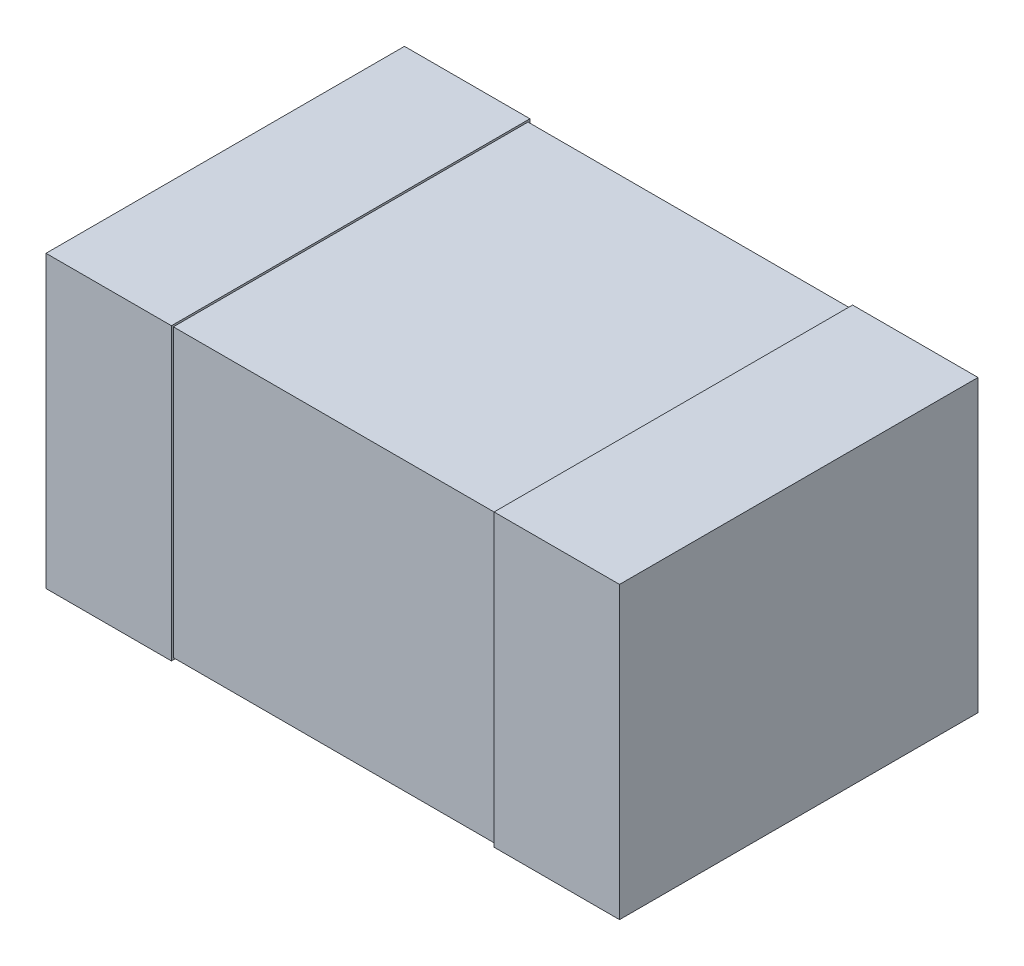
ISO-10303-21;
HEADER;
FILE_DESCRIPTION(('STEP AP214'),'2;1');
FILE_NAME('part.step','',(''),(''),'','','');
FILE_SCHEMA(('AUTOMOTIVE_DESIGN { 1 0 10303 214 1 1 1 1 }'));
ENDSEC;
DATA;
#1=APPLICATION_CONTEXT('core data for automotive mechanical design processes');
#2=APPLICATION_PROTOCOL_DEFINITION('international standard','automotive_design',2000,#1);
#3=PRODUCT_CONTEXT('',#1,'mechanical');
#4=PRODUCT('Part','Part','',(#3));
#5=PRODUCT_RELATED_PRODUCT_CATEGORY('part','',(#4));
#6=PRODUCT_DEFINITION_FORMATION('','',#4);
#7=PRODUCT_DEFINITION_CONTEXT('part definition',#1,'design');
#8=PRODUCT_DEFINITION('design','',#6,#7);
#9=PRODUCT_DEFINITION_SHAPE('','',#8);
#10=(LENGTH_UNIT() NAMED_UNIT(*) SI_UNIT(.MILLI.,.METRE.));
#11=(NAMED_UNIT(*) PLANE_ANGLE_UNIT() SI_UNIT($,.RADIAN.));
#12=(NAMED_UNIT(*) SI_UNIT($,.STERADIAN.) SOLID_ANGLE_UNIT());
#13=UNCERTAINTY_MEASURE_WITH_UNIT(LENGTH_MEASURE(1.E-05),#10,'distance_accuracy_value','');
#14=(GEOMETRIC_REPRESENTATION_CONTEXT(3) GLOBAL_UNCERTAINTY_ASSIGNED_CONTEXT((#13)) GLOBAL_UNIT_ASSIGNED_CONTEXT((#10,
#11,#12)) REPRESENTATION_CONTEXT('',''));
#15=CARTESIAN_POINT('',(0.,0.,0.));
#16=DIRECTION('',(0.,0.,1.));
#17=DIRECTION('',(1.,0.,0.));
#18=AXIS2_PLACEMENT_3D('',#15,#16,#17);
#19=CARTESIAN_POINT('',(0.8,-0.405,0.0762));
#20=DIRECTION('',(1.,0.,0.));
#21=DIRECTION('',(0.,0.,-1.));
#22=AXIS2_PLACEMENT_3D('',#19,#20,#21);
#23=PLANE('',#22);
#24=DIRECTION('',(0.,0.,-1.));
#25=VECTOR('',#24,1.);
#26=CARTESIAN_POINT('',(0.8,-0.405,0.0762));
#27=LINE('',#26,#25);
#28=CARTESIAN_POINT('',(0.8,-0.405,0.0762));
#29=VERTEX_POINT('',#28);
#30=CARTESIAN_POINT('',(0.8,-0.405,1.0762));
#31=VERTEX_POINT('',#30);
#32=EDGE_CURVE('E118',#29,#31,#27,.F.);
#33=ORIENTED_EDGE('',*,*,#32,.F.);
#34=DIRECTION('',(0.,1.,0.));
#35=VECTOR('',#34,1.);
#36=CARTESIAN_POINT('',(0.8,0.,0.0762));
#37=LINE('',#36,#35);
#38=CARTESIAN_POINT('',(0.8,0.405,0.0762));
#39=VERTEX_POINT('',#38);
#40=EDGE_CURVE('E20',#29,#39,#37,.T.);
#41=ORIENTED_EDGE('',*,*,#40,.T.);
#42=DIRECTION('',(0.,0.,1.));
#43=VECTOR('',#42,1.);
#44=CARTESIAN_POINT('',(0.8,0.405,0.0762));
#45=LINE('',#44,#43);
#46=CARTESIAN_POINT('',(0.8,0.405,1.0762));
#47=VERTEX_POINT('',#46);
#48=EDGE_CURVE('E108',#47,#39,#45,.F.);
#49=ORIENTED_EDGE('',*,*,#48,.F.);
#50=DIRECTION('',(0.,1.,0.));
#51=VECTOR('',#50,1.);
#52=CARTESIAN_POINT('',(0.8,0.,1.0762));
#53=LINE('',#52,#51);
#54=EDGE_CURVE('E103',#31,#47,#53,.T.);
#55=ORIENTED_EDGE('',*,*,#54,.F.);
#56=EDGE_LOOP('',(#33,#41,#49,#55));
#57=FACE_BOUND('',#56,.T.);
#58=ADVANCED_FACE('F17',(#57),#23,.T.);
#59=CARTESIAN_POINT('',(-0.8,0.405,0.0762));
#60=DIRECTION('',(-1.,0.,0.));
#61=DIRECTION('',(0.,0.,1.));
#62=AXIS2_PLACEMENT_3D('',#59,#60,#61);
#63=PLANE('',#62);
#64=DIRECTION('',(0.,0.,1.));
#65=VECTOR('',#64,1.);
#66=CARTESIAN_POINT('',(-0.8,0.405,0.0762));
#67=LINE('',#66,#65);
#68=CARTESIAN_POINT('',(-0.8,0.405,0.0762));
#69=VERTEX_POINT('',#68);
#70=CARTESIAN_POINT('',(-0.8,0.405,1.0762));
#71=VERTEX_POINT('',#70);
#72=EDGE_CURVE('E148',#69,#71,#67,.T.);
#73=ORIENTED_EDGE('',*,*,#72,.F.);
#74=DIRECTION('',(0.,1.,0.));
#75=VECTOR('',#74,1.);
#76=CARTESIAN_POINT('',(-0.8,0.,0.0762));
#77=LINE('',#76,#75);
#78=CARTESIAN_POINT('',(-0.8,-0.405,0.0762));
#79=VERTEX_POINT('',#78);
#80=EDGE_CURVE('E134',#69,#79,#77,.F.);
#81=ORIENTED_EDGE('',*,*,#80,.T.);
#82=DIRECTION('',(0.,0.,-1.));
#83=VECTOR('',#82,1.);
#84=CARTESIAN_POINT('',(-0.8,-0.405,0.0762));
#85=LINE('',#84,#83);
#86=CARTESIAN_POINT('',(-0.8,-0.405,1.0762));
#87=VERTEX_POINT('',#86);
#88=EDGE_CURVE('E137',#87,#79,#85,.T.);
#89=ORIENTED_EDGE('',*,*,#88,.F.);
#90=DIRECTION('',(0.,1.,0.));
#91=VECTOR('',#90,1.);
#92=CARTESIAN_POINT('',(-0.8,0.,1.0762));
#93=LINE('',#92,#91);
#94=EDGE_CURVE('E141',#71,#87,#93,.F.);
#95=ORIENTED_EDGE('',*,*,#94,.F.);
#96=EDGE_LOOP('',(#73,#81,#89,#95));
#97=FACE_BOUND('',#96,.T.);
#98=ADVANCED_FACE('F236',(#97),#63,.T.);
#99=CARTESIAN_POINT('',(0.,0.,0.0762));
#100=DIRECTION('',(0.,0.,1.));
#101=DIRECTION('',(1.,0.,0.));
#102=AXIS2_PLACEMENT_3D('',#99,#100,#101);
#103=PLANE('',#102);
#104=ORIENTED_EDGE('',*,*,#40,.F.);
#105=DIRECTION('',(1.,0.,0.));
#106=VECTOR('',#105,1.);
#107=CARTESIAN_POINT('',(-0.8,-0.405,0.0762));
#108=LINE('',#107,#106);
#109=CARTESIAN_POINT('',(0.45,-0.405,0.0762));
#110=VERTEX_POINT('',#109);
#111=EDGE_CURVE('E129',#110,#29,#108,.T.);
#112=ORIENTED_EDGE('',*,*,#111,.F.);
#113=DIRECTION('',(0.,1.,0.));
#114=VECTOR('',#113,1.);
#115=CARTESIAN_POINT('',(0.45,-0.405,0.0762));
#116=LINE('',#115,#114);
#117=CARTESIAN_POINT('',(0.45,0.405,0.0762));
#118=VERTEX_POINT('',#117);
#119=EDGE_CURVE('E124',#110,#118,#116,.T.);
#120=ORIENTED_EDGE('',*,*,#119,.T.);
#121=DIRECTION('',(1.,0.,0.));
#122=VECTOR('',#121,1.);
#123=CARTESIAN_POINT('',(0.8,0.405,0.0762));
#124=LINE('',#123,#122);
#125=EDGE_CURVE('E113',#39,#118,#124,.F.);
#126=ORIENTED_EDGE('',*,*,#125,.F.);
#127=EDGE_LOOP('',(#104,#112,#120,#126));
#128=FACE_BOUND('',#127,.T.);
#129=ADVANCED_FACE('F123',(#128),#103,.F.);
#130=CARTESIAN_POINT('',(0.8,0.405,0.0762));
#131=DIRECTION('',(0.,1.,0.));
#132=DIRECTION('',(0.,0.,1.));
#133=AXIS2_PLACEMENT_3D('',#130,#131,#132);
#134=PLANE('',#133);
#135=ORIENTED_EDGE('',*,*,#125,.T.);
#136=DIRECTION('',(0.,0.,-1.));
#137=VECTOR('',#136,1.);
#138=CARTESIAN_POINT('',(0.45,0.405,0.081534));
#139=LINE('',#138,#137);
#140=CARTESIAN_POINT('',(0.45,0.405,1.0762));
#141=VERTEX_POINT('',#140);
#142=EDGE_CURVE('E155',#118,#141,#139,.F.);
#143=ORIENTED_EDGE('',*,*,#142,.T.);
#144=DIRECTION('',(1.,0.,0.));
#145=VECTOR('',#144,1.);
#146=CARTESIAN_POINT('',(0.,0.405,1.0762));
#147=LINE('',#146,#145);
#148=EDGE_CURVE('E115',#47,#141,#147,.F.);
#149=ORIENTED_EDGE('',*,*,#148,.F.);
#150=ORIENTED_EDGE('',*,*,#48,.T.);
#151=EDGE_LOOP('',(#135,#143,#149,#150));
#152=FACE_BOUND('',#151,.T.);
#153=ADVANCED_FACE('F110',(#152),#134,.T.);
#154=CARTESIAN_POINT('',(0.,0.,1.0762));
#155=DIRECTION('',(0.,0.,1.));
#156=DIRECTION('',(1.,0.,0.));
#157=AXIS2_PLACEMENT_3D('',#154,#155,#156);
#158=PLANE('',#157);
#159=ORIENTED_EDGE('',*,*,#148,.T.);
#160=DIRECTION('',(0.,1.,0.));
#161=VECTOR('',#160,1.);
#162=CARTESIAN_POINT('',(0.45,-0.405,1.0762));
#163=LINE('',#162,#161);
#164=CARTESIAN_POINT('',(0.45,-0.405,1.0762));
#165=VERTEX_POINT('',#164);
#166=EDGE_CURVE('E157',#141,#165,#163,.F.);
#167=ORIENTED_EDGE('',*,*,#166,.T.);
#168=DIRECTION('',(1.,0.,0.));
#169=VECTOR('',#168,1.);
#170=CARTESIAN_POINT('',(-0.8,-0.405,1.0762));
#171=LINE('',#170,#169);
#172=EDGE_CURVE('E132',#31,#165,#171,.F.);
#173=ORIENTED_EDGE('',*,*,#172,.F.);
#174=ORIENTED_EDGE('',*,*,#54,.T.);
#175=EDGE_LOOP('',(#159,#167,#173,#174));
#176=FACE_BOUND('',#175,.T.);
#177=ADVANCED_FACE('F270',(#176),#158,.T.);
#178=CARTESIAN_POINT('',(-0.8,-0.405,0.0762));
#179=DIRECTION('',(0.,-1.,0.));
#180=DIRECTION('',(0.,0.,-1.));
#181=AXIS2_PLACEMENT_3D('',#178,#179,#180);
#182=PLANE('',#181);
#183=ORIENTED_EDGE('',*,*,#172,.T.);
#184=DIRECTION('',(0.,0.,-1.));
#185=VECTOR('',#184,1.);
#186=CARTESIAN_POINT('',(0.45,-0.405,0.081534));
#187=LINE('',#186,#185);
#188=EDGE_CURVE('E160',#165,#110,#187,.T.);
#189=ORIENTED_EDGE('',*,*,#188,.T.);
#190=ORIENTED_EDGE('',*,*,#111,.T.);
#191=ORIENTED_EDGE('',*,*,#32,.T.);
#192=EDGE_LOOP('',(#183,#189,#190,#191));
#193=FACE_BOUND('',#192,.T.);
#194=ADVANCED_FACE('F267',(#193),#182,.T.);
#195=CARTESIAN_POINT('',(0.,0.,0.0762));
#196=DIRECTION('',(0.,0.,1.));
#197=DIRECTION('',(1.,0.,0.));
#198=AXIS2_PLACEMENT_3D('',#195,#196,#197);
#199=PLANE('',#198);
#200=ORIENTED_EDGE('',*,*,#80,.F.);
#201=DIRECTION('',(1.,0.,0.));
#202=VECTOR('',#201,1.);
#203=CARTESIAN_POINT('',(0.8,0.405,0.0762));
#204=LINE('',#203,#202);
#205=CARTESIAN_POINT('',(-0.45,0.405,0.0762));
#206=VERTEX_POINT('',#205);
#207=EDGE_CURVE('E145',#206,#69,#204,.F.);
#208=ORIENTED_EDGE('',*,*,#207,.F.);
#209=DIRECTION('',(0.,1.,0.));
#210=VECTOR('',#209,1.);
#211=CARTESIAN_POINT('',(-0.45,-0.405,0.0762));
#212=LINE('',#211,#210);
#213=CARTESIAN_POINT('',(-0.45,-0.405,0.0762));
#214=VERTEX_POINT('',#213);
#215=EDGE_CURVE('E173',#206,#214,#212,.F.);
#216=ORIENTED_EDGE('',*,*,#215,.T.);
#217=DIRECTION('',(1.,0.,0.));
#218=VECTOR('',#217,1.);
#219=CARTESIAN_POINT('',(-0.8,-0.405,0.0762));
#220=LINE('',#219,#218);
#221=EDGE_CURVE('E139',#79,#214,#220,.T.);
#222=ORIENTED_EDGE('',*,*,#221,.F.);
#223=EDGE_LOOP('',(#200,#208,#216,#222));
#224=FACE_BOUND('',#223,.T.);
#225=ADVANCED_FACE('F228',(#224),#199,.F.);
#226=CARTESIAN_POINT('',(-0.8,-0.405,0.0762));
#227=DIRECTION('',(0.,-1.,0.));
#228=DIRECTION('',(0.,0.,-1.));
#229=AXIS2_PLACEMENT_3D('',#226,#227,#228);
#230=PLANE('',#229);
#231=ORIENTED_EDGE('',*,*,#221,.T.);
#232=DIRECTION('',(0.,0.,1.));
#233=VECTOR('',#232,1.);
#234=CARTESIAN_POINT('',(-0.45,-0.405,0.0762));
#235=LINE('',#234,#233);
#236=CARTESIAN_POINT('',(-0.45,-0.405,1.0762));
#237=VERTEX_POINT('',#236);
#238=EDGE_CURVE('E176',#214,#237,#235,.T.);
#239=ORIENTED_EDGE('',*,*,#238,.T.);
#240=DIRECTION('',(1.,0.,0.));
#241=VECTOR('',#240,1.);
#242=CARTESIAN_POINT('',(0.,-0.405,1.0762));
#243=LINE('',#242,#241);
#244=EDGE_CURVE('E143',#87,#237,#243,.T.);
#245=ORIENTED_EDGE('',*,*,#244,.F.);
#246=ORIENTED_EDGE('',*,*,#88,.T.);
#247=EDGE_LOOP('',(#231,#239,#245,#246));
#248=FACE_BOUND('',#247,.T.);
#249=ADVANCED_FACE('F224',(#248),#230,.T.);
#250=CARTESIAN_POINT('',(0.,0.,1.0762));
#251=DIRECTION('',(0.,0.,1.));
#252=DIRECTION('',(1.,0.,0.));
#253=AXIS2_PLACEMENT_3D('',#250,#251,#252);
#254=PLANE('',#253);
#255=ORIENTED_EDGE('',*,*,#244,.T.);
#256=DIRECTION('',(0.,1.,0.));
#257=VECTOR('',#256,1.);
#258=CARTESIAN_POINT('',(-0.45,-0.405,1.0762));
#259=LINE('',#258,#257);
#260=CARTESIAN_POINT('',(-0.45,0.405,1.0762));
#261=VERTEX_POINT('',#260);
#262=EDGE_CURVE('E179',#237,#261,#259,.T.);
#263=ORIENTED_EDGE('',*,*,#262,.T.);
#264=DIRECTION('',(1.,0.,0.));
#265=VECTOR('',#264,1.);
#266=CARTESIAN_POINT('',(0.8,0.405,1.0762));
#267=LINE('',#266,#265);
#268=EDGE_CURVE('E150',#71,#261,#267,.T.);
#269=ORIENTED_EDGE('',*,*,#268,.F.);
#270=ORIENTED_EDGE('',*,*,#94,.T.);
#271=EDGE_LOOP('',(#255,#263,#269,#270));
#272=FACE_BOUND('',#271,.T.);
#273=ADVANCED_FACE('F234',(#272),#254,.T.);
#274=CARTESIAN_POINT('',(0.8,0.405,0.0762));
#275=DIRECTION('',(0.,1.,0.));
#276=DIRECTION('',(0.,0.,1.));
#277=AXIS2_PLACEMENT_3D('',#274,#275,#276);
#278=PLANE('',#277);
#279=ORIENTED_EDGE('',*,*,#268,.T.);
#280=DIRECTION('',(0.,0.,1.));
#281=VECTOR('',#280,1.);
#282=CARTESIAN_POINT('',(-0.45,0.405,0.0762));
#283=LINE('',#282,#281);
#284=EDGE_CURVE('E182',#261,#206,#283,.F.);
#285=ORIENTED_EDGE('',*,*,#284,.T.);
#286=ORIENTED_EDGE('',*,*,#207,.T.);
#287=ORIENTED_EDGE('',*,*,#72,.T.);
#288=EDGE_LOOP('',(#279,#285,#286,#287));
#289=FACE_BOUND('',#288,.T.);
#290=ADVANCED_FACE('F232',(#289),#278,.T.);
#291=CARTESIAN_POINT('',(-0.45,0.399666,0.0762));
#292=DIRECTION('',(0.,-1.,0.));
#293=DIRECTION('',(0.,0.,-1.));
#294=AXIS2_PLACEMENT_3D('',#291,#292,#293);
#295=PLANE('',#294);
#296=DIRECTION('',(-1.,0.,0.));
#297=VECTOR('',#296,1.);
#298=CARTESIAN_POINT('',(-0.45,0.399666,1.070866));
#299=LINE('',#298,#297);
#300=CARTESIAN_POINT('',(-0.45,0.399666,1.070866));
#301=VERTEX_POINT('',#300);
#302=CARTESIAN_POINT('',(0.45,0.399666,1.070866));
#303=VERTEX_POINT('',#302);
#304=EDGE_CURVE('E152',#301,#303,#299,.F.);
#305=ORIENTED_EDGE('',*,*,#304,.T.);
#306=DIRECTION('',(0.,0.,-1.));
#307=VECTOR('',#306,1.);
#308=CARTESIAN_POINT('',(0.45,0.399666,0.081534));
#309=LINE('',#308,#307);
#310=CARTESIAN_POINT('',(0.45,0.399666,0.081534));
#311=VERTEX_POINT('',#310);
#312=EDGE_CURVE('E166',#303,#311,#309,.T.);
#313=ORIENTED_EDGE('',*,*,#312,.T.);
#314=DIRECTION('',(1.,0.,0.));
#315=VECTOR('',#314,1.);
#316=CARTESIAN_POINT('',(-0.45,0.399666,0.081534));
#317=LINE('',#316,#315);
#318=CARTESIAN_POINT('',(-0.45,0.399666,0.081534));
#319=VERTEX_POINT('',#318);
#320=EDGE_CURVE('E171',#311,#319,#317,.F.);
#321=ORIENTED_EDGE('',*,*,#320,.T.);
#322=DIRECTION('',(0.,0.,1.));
#323=VECTOR('',#322,1.);
#324=CARTESIAN_POINT('',(-0.45,0.399666,0.0762));
#325=LINE('',#324,#323);
#326=EDGE_CURVE('E186',#319,#301,#325,.T.);
#327=ORIENTED_EDGE('',*,*,#326,.T.);
#328=EDGE_LOOP('',(#305,#313,#321,#327));
#329=FACE_BOUND('',#328,.T.);
#330=ADVANCED_FACE('F255',(#329),#295,.F.);
#331=CARTESIAN_POINT('',(-0.45,0.405,1.070866));
#332=DIRECTION('',(0.,0.,-1.));
#333=DIRECTION('',(-1.,0.,0.));
#334=AXIS2_PLACEMENT_3D('',#331,#332,#333);
#335=PLANE('',#334);
#336=DIRECTION('',(1.,0.,0.));
#337=VECTOR('',#336,1.);
#338=CARTESIAN_POINT('',(-0.45,-0.399666,1.070866));
#339=LINE('',#338,#337);
#340=CARTESIAN_POINT('',(-0.45,-0.399666,1.070866));
#341=VERTEX_POINT('',#340);
#342=CARTESIAN_POINT('',(0.45,-0.399666,1.070866));
#343=VERTEX_POINT('',#342);
#344=EDGE_CURVE('E192',#341,#343,#339,.T.);
#345=ORIENTED_EDGE('',*,*,#344,.T.);
#346=DIRECTION('',(0.,1.,0.));
#347=VECTOR('',#346,1.);
#348=CARTESIAN_POINT('',(0.45,-0.405,1.070866));
#349=LINE('',#348,#347);
#350=EDGE_CURVE('E163',#343,#303,#349,.T.);
#351=ORIENTED_EDGE('',*,*,#350,.T.);
#352=ORIENTED_EDGE('',*,*,#304,.F.);
#353=DIRECTION('',(0.,1.,0.));
#354=VECTOR('',#353,1.);
#355=CARTESIAN_POINT('',(-0.45,-0.405,1.070866));
#356=LINE('',#355,#354);
#357=EDGE_CURVE('E189',#301,#341,#356,.F.);
#358=ORIENTED_EDGE('',*,*,#357,.T.);
#359=EDGE_LOOP('',(#345,#351,#352,#358));
#360=FACE_BOUND('',#359,.T.);
#361=ADVANCED_FACE('F211',(#360),#335,.F.);
#362=CARTESIAN_POINT('',(0.45,-0.405,0.081534));
#363=DIRECTION('',(1.,0.,0.));
#364=DIRECTION('',(0.,0.,-1.));
#365=AXIS2_PLACEMENT_3D('',#362,#363,#364);
#366=PLANE('',#365);
#367=ORIENTED_EDGE('',*,*,#350,.F.);
#368=DIRECTION('',(0.,0.,1.));
#369=VECTOR('',#368,1.);
#370=CARTESIAN_POINT('',(0.45,-0.399666,1.0762));
#371=LINE('',#370,#369);
#372=CARTESIAN_POINT('',(0.45,-0.399666,0.081534));
#373=VERTEX_POINT('',#372);
#374=EDGE_CURVE('E195',#343,#373,#371,.F.);
#375=ORIENTED_EDGE('',*,*,#374,.T.);
#376=DIRECTION('',(0.,1.,0.));
#377=VECTOR('',#376,1.);
#378=CARTESIAN_POINT('',(0.45,-0.405,0.081534));
#379=LINE('',#378,#377);
#380=EDGE_CURVE('E168',#373,#311,#379,.T.);
#381=ORIENTED_EDGE('',*,*,#380,.T.);
#382=ORIENTED_EDGE('',*,*,#312,.F.);
#383=EDGE_LOOP('',(#367,#375,#381,#382));
#384=FACE_BOUND('',#383,.T.);
#385=ORIENTED_EDGE('',*,*,#166,.F.);
#386=ORIENTED_EDGE('',*,*,#142,.F.);
#387=ORIENTED_EDGE('',*,*,#119,.F.);
#388=ORIENTED_EDGE('',*,*,#188,.F.);
#389=EDGE_LOOP('',(#385,#386,#387,#388));
#390=FACE_BOUND('',#389,.T.);
#391=ADVANCED_FACE('F207',(#384,#390),#366,.F.);
#392=CARTESIAN_POINT('',(-0.45,-0.405,0.081534));
#393=DIRECTION('',(0.,0.,1.));
#394=DIRECTION('',(1.,0.,0.));
#395=AXIS2_PLACEMENT_3D('',#392,#393,#394);
#396=PLANE('',#395);
#397=ORIENTED_EDGE('',*,*,#320,.F.);
#398=ORIENTED_EDGE('',*,*,#380,.F.);
#399=DIRECTION('',(1.,0.,0.));
#400=VECTOR('',#399,1.);
#401=CARTESIAN_POINT('',(-0.45,-0.399666,0.0815340000000001));
#402=LINE('',#401,#400);
#403=CARTESIAN_POINT('',(-0.45,-0.399666,0.081534));
#404=VERTEX_POINT('',#403);
#405=EDGE_CURVE('E26',#373,#404,#402,.F.);
#406=ORIENTED_EDGE('',*,*,#405,.T.);
#407=DIRECTION('',(0.,1.,0.));
#408=VECTOR('',#407,1.);
#409=CARTESIAN_POINT('',(-0.45,-0.405,0.081534));
#410=LINE('',#409,#408);
#411=EDGE_CURVE('E34',#404,#319,#410,.T.);
#412=ORIENTED_EDGE('',*,*,#411,.T.);
#413=EDGE_LOOP('',(#397,#398,#406,#412));
#414=FACE_BOUND('',#413,.T.);
#415=ADVANCED_FACE('F202',(#414),#396,.F.);
#416=CARTESIAN_POINT('',(-0.45,-0.405,0.0762));
#417=DIRECTION('',(-1.,0.,0.));
#418=DIRECTION('',(0.,0.,1.));
#419=AXIS2_PLACEMENT_3D('',#416,#417,#418);
#420=PLANE('',#419);
#421=ORIENTED_EDGE('',*,*,#326,.F.);
#422=ORIENTED_EDGE('',*,*,#411,.F.);
#423=DIRECTION('',(0.,0.,1.));
#424=VECTOR('',#423,1.);
#425=CARTESIAN_POINT('',(-0.45,-0.399666,1.0762));
#426=LINE('',#425,#424);
#427=EDGE_CURVE('E11',#404,#341,#426,.T.);
#428=ORIENTED_EDGE('',*,*,#427,.T.);
#429=ORIENTED_EDGE('',*,*,#357,.F.);
#430=EDGE_LOOP('',(#421,#422,#428,#429));
#431=FACE_BOUND('',#430,.T.);
#432=ORIENTED_EDGE('',*,*,#262,.F.);
#433=ORIENTED_EDGE('',*,*,#238,.F.);
#434=ORIENTED_EDGE('',*,*,#215,.F.);
#435=ORIENTED_EDGE('',*,*,#284,.F.);
#436=EDGE_LOOP('',(#432,#433,#434,#435));
#437=FACE_BOUND('',#436,.T.);
#438=ADVANCED_FACE('F213',(#431,#437),#420,.F.);
#439=CARTESIAN_POINT('',(-0.45,-0.399666,1.0762));
#440=DIRECTION('',(0.,1.,0.));
#441=DIRECTION('',(0.,0.,1.));
#442=AXIS2_PLACEMENT_3D('',#439,#440,#441);
#443=PLANE('',#442);
#444=ORIENTED_EDGE('',*,*,#405,.F.);
#445=ORIENTED_EDGE('',*,*,#374,.F.);
#446=ORIENTED_EDGE('',*,*,#344,.F.);
#447=ORIENTED_EDGE('',*,*,#427,.F.);
#448=EDGE_LOOP('',(#444,#445,#446,#447));
#449=FACE_BOUND('',#448,.T.);
#450=ADVANCED_FACE('F205',(#449),#443,.F.);
#451=CLOSED_SHELL('',(#58,#98,#129,#153,#177,#194,#225,#249,#273,#290,#330,#361,#391,#415,#438,#450));
#452=MANIFOLD_SOLID_BREP('B1',#451);
#453=ADVANCED_BREP_SHAPE_REPRESENTATION('',(#18,#452),#14);
#454=SHAPE_DEFINITION_REPRESENTATION(#9,#453);
ENDSEC;
END-ISO-10303-21;
